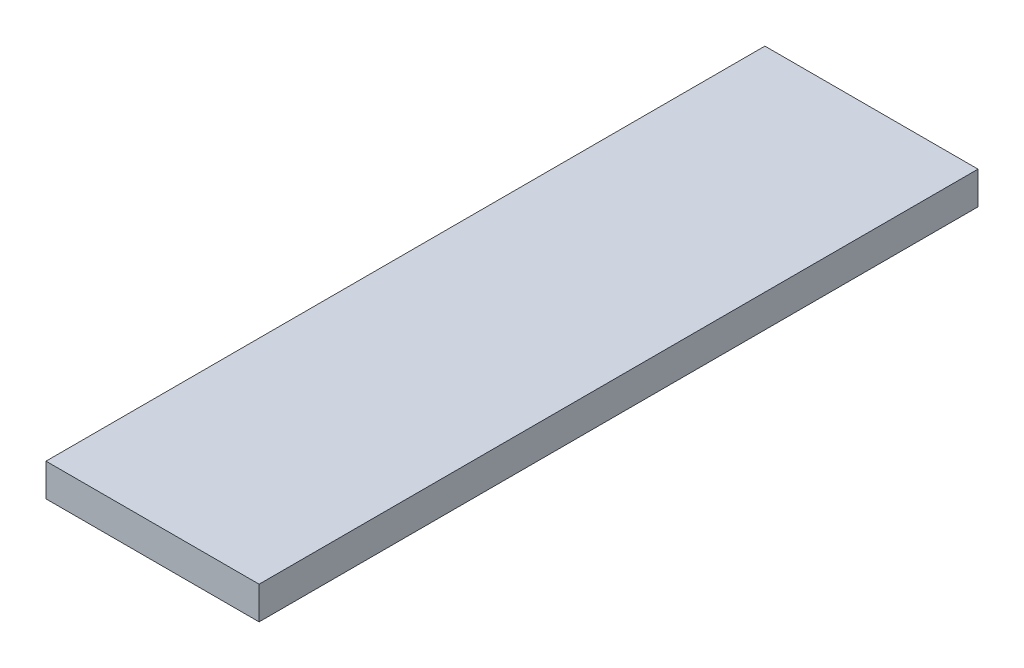
ISO-10303-21;
HEADER;
FILE_DESCRIPTION(('STEP AP214'),'2;1');
FILE_NAME('part.step','',(''),(''),'','','');
FILE_SCHEMA(('AUTOMOTIVE_DESIGN { 1 0 10303 214 1 1 1 1 }'));
ENDSEC;
DATA;
#1=APPLICATION_CONTEXT('core data for automotive mechanical design processes');
#2=APPLICATION_PROTOCOL_DEFINITION('international standard','automotive_design',2000,#1);
#3=PRODUCT_CONTEXT('',#1,'mechanical');
#4=PRODUCT('Part','Part','',(#3));
#5=PRODUCT_RELATED_PRODUCT_CATEGORY('part','',(#4));
#6=PRODUCT_DEFINITION_FORMATION('','',#4);
#7=PRODUCT_DEFINITION_CONTEXT('part definition',#1,'design');
#8=PRODUCT_DEFINITION('design','',#6,#7);
#9=PRODUCT_DEFINITION_SHAPE('','',#8);
#10=(LENGTH_UNIT() NAMED_UNIT(*) SI_UNIT(.MILLI.,.METRE.));
#11=(NAMED_UNIT(*) PLANE_ANGLE_UNIT() SI_UNIT($,.RADIAN.));
#12=(NAMED_UNIT(*) SI_UNIT($,.STERADIAN.) SOLID_ANGLE_UNIT());
#13=UNCERTAINTY_MEASURE_WITH_UNIT(LENGTH_MEASURE(1.E-05),#10,'distance_accuracy_value','');
#14=(GEOMETRIC_REPRESENTATION_CONTEXT(3) GLOBAL_UNCERTAINTY_ASSIGNED_CONTEXT((#13)) GLOBAL_UNIT_ASSIGNED_CONTEXT((#10,
#11,#12)) REPRESENTATION_CONTEXT('',''));
#15=CARTESIAN_POINT('',(0.,0.,0.));
#16=DIRECTION('',(0.,0.,1.));
#17=DIRECTION('',(1.,0.,0.));
#18=AXIS2_PLACEMENT_3D('',#15,#16,#17);
#19=CARTESIAN_POINT('',(20.7058145066696,-6.35,-69.85));
#20=DIRECTION('',(1.,0.,0.));
#21=DIRECTION('',(0.,0.,-1.));
#22=AXIS2_PLACEMENT_3D('',#19,#20,#21);
#23=PLANE('',#22);
#24=DIRECTION('',(0.,0.,-1.));
#25=VECTOR('',#24,1.);
#26=CARTESIAN_POINT('',(20.7058145066696,0.,-69.85));
#27=LINE('',#26,#25);
#28=CARTESIAN_POINT('',(20.7058145066696,0.,69.85));
#29=VERTEX_POINT('',#28);
#30=CARTESIAN_POINT('',(20.7058145066696,0.,-69.85));
#31=VERTEX_POINT('',#30);
#32=EDGE_CURVE('E97',#29,#31,#27,.T.);
#33=ORIENTED_EDGE('',*,*,#32,.F.);
#34=DIRECTION('',(0.,1.,0.));
#35=VECTOR('',#34,1.);
#36=CARTESIAN_POINT('',(20.7058145066696,-6.35,69.85));
#37=LINE('',#36,#35);
#38=CARTESIAN_POINT('',(20.7058145066696,-6.35,69.85));
#39=VERTEX_POINT('',#38);
#40=EDGE_CURVE('E11',#39,#29,#37,.T.);
#41=ORIENTED_EDGE('',*,*,#40,.F.);
#42=DIRECTION('',(0.,0.,-1.));
#43=VECTOR('',#42,1.);
#44=CARTESIAN_POINT('',(20.7058145066696,-6.35,-69.85));
#45=LINE('',#44,#43);
#46=CARTESIAN_POINT('',(20.7058145066696,-6.35,-69.85));
#47=VERTEX_POINT('',#46);
#48=EDGE_CURVE('E91',#39,#47,#45,.T.);
#49=ORIENTED_EDGE('',*,*,#48,.T.);
#50=DIRECTION('',(0.,1.,0.));
#51=VECTOR('',#50,1.);
#52=CARTESIAN_POINT('',(20.7058145066696,-6.35,-69.85));
#53=LINE('',#52,#51);
#54=EDGE_CURVE('E36',#47,#31,#53,.T.);
#55=ORIENTED_EDGE('',*,*,#54,.T.);
#56=EDGE_LOOP('',(#33,#41,#49,#55));
#57=FACE_BOUND('',#56,.T.);
#58=ADVANCED_FACE('F33',(#57),#23,.T.);
#59=CARTESIAN_POINT('',(-20.7058145066696,-6.35,69.85));
#60=DIRECTION('',(0.,0.,1.));
#61=DIRECTION('',(1.,0.,0.));
#62=AXIS2_PLACEMENT_3D('',#59,#60,#61);
#63=PLANE('',#62);
#64=DIRECTION('',(1.,0.,0.));
#65=VECTOR('',#64,1.);
#66=CARTESIAN_POINT('',(-20.7058145066696,0.,69.85));
#67=LINE('',#66,#65);
#68=CARTESIAN_POINT('',(-20.7058145066696,0.,69.85));
#69=VERTEX_POINT('',#68);
#70=EDGE_CURVE('E93',#69,#29,#67,.T.);
#71=ORIENTED_EDGE('',*,*,#70,.F.);
#72=DIRECTION('',(0.,1.,0.));
#73=VECTOR('',#72,1.);
#74=CARTESIAN_POINT('',(-20.7058145066696,-6.35,69.85));
#75=LINE('',#74,#73);
#76=CARTESIAN_POINT('',(-20.7058145066696,-6.35,69.85));
#77=VERTEX_POINT('',#76);
#78=EDGE_CURVE('E42',#77,#69,#75,.T.);
#79=ORIENTED_EDGE('',*,*,#78,.F.);
#80=DIRECTION('',(1.,0.,0.));
#81=VECTOR('',#80,1.);
#82=CARTESIAN_POINT('',(-20.7058145066696,-6.35,69.85));
#83=LINE('',#82,#81);
#84=EDGE_CURVE('E88',#77,#39,#83,.T.);
#85=ORIENTED_EDGE('',*,*,#84,.T.);
#86=ORIENTED_EDGE('',*,*,#40,.T.);
#87=EDGE_LOOP('',(#71,#79,#85,#86));
#88=FACE_BOUND('',#87,.T.);
#89=ADVANCED_FACE('F107',(#88),#63,.T.);
#90=CARTESIAN_POINT('',(-20.7058145066696,-6.35,-69.85));
#91=DIRECTION('',(-1.,0.,0.));
#92=DIRECTION('',(0.,0.,1.));
#93=AXIS2_PLACEMENT_3D('',#90,#91,#92);
#94=PLANE('',#93);
#95=DIRECTION('',(0.,0.,1.));
#96=VECTOR('',#95,1.);
#97=CARTESIAN_POINT('',(-20.7058145066696,0.,-69.85));
#98=LINE('',#97,#96);
#99=CARTESIAN_POINT('',(-20.7058145066696,0.,-69.85));
#100=VERTEX_POINT('',#99);
#101=EDGE_CURVE('E83',#100,#69,#98,.T.);
#102=ORIENTED_EDGE('',*,*,#101,.F.);
#103=DIRECTION('',(0.,1.,0.));
#104=VECTOR('',#103,1.);
#105=CARTESIAN_POINT('',(-20.7058145066696,-6.35,-69.85));
#106=LINE('',#105,#104);
#107=CARTESIAN_POINT('',(-20.7058145066696,-6.35,-69.85));
#108=VERTEX_POINT('',#107);
#109=EDGE_CURVE('E78',#108,#100,#106,.T.);
#110=ORIENTED_EDGE('',*,*,#109,.F.);
#111=DIRECTION('',(0.,0.,1.));
#112=VECTOR('',#111,1.);
#113=CARTESIAN_POINT('',(-20.7058145066696,-6.35,-69.85));
#114=LINE('',#113,#112);
#115=EDGE_CURVE('E81',#108,#77,#114,.T.);
#116=ORIENTED_EDGE('',*,*,#115,.T.);
#117=ORIENTED_EDGE('',*,*,#78,.T.);
#118=EDGE_LOOP('',(#102,#110,#116,#117));
#119=FACE_BOUND('',#118,.T.);
#120=ADVANCED_FACE('F80',(#119),#94,.T.);
#121=CARTESIAN_POINT('',(-20.7058145066696,-6.35,-69.85));
#122=DIRECTION('',(0.,0.,-1.));
#123=DIRECTION('',(-1.,0.,0.));
#124=AXIS2_PLACEMENT_3D('',#121,#122,#123);
#125=PLANE('',#124);
#126=DIRECTION('',(-1.,0.,0.));
#127=VECTOR('',#126,1.);
#128=CARTESIAN_POINT('',(-20.7058145066696,0.,-69.85));
#129=LINE('',#128,#127);
#130=EDGE_CURVE('E100',#31,#100,#129,.T.);
#131=ORIENTED_EDGE('',*,*,#130,.F.);
#132=ORIENTED_EDGE('',*,*,#54,.F.);
#133=DIRECTION('',(-1.,0.,0.));
#134=VECTOR('',#133,1.);
#135=CARTESIAN_POINT('',(-20.7058145066696,-6.35,-69.85));
#136=LINE('',#135,#134);
#137=EDGE_CURVE('E87',#47,#108,#136,.T.);
#138=ORIENTED_EDGE('',*,*,#137,.T.);
#139=ORIENTED_EDGE('',*,*,#109,.T.);
#140=EDGE_LOOP('',(#131,#132,#138,#139));
#141=FACE_BOUND('',#140,.T.);
#142=ADVANCED_FACE('F90',(#141),#125,.T.);
#143=CARTESIAN_POINT('',(0.,-6.35,0.));
#144=DIRECTION('',(0.,1.,0.));
#145=DIRECTION('',(0.,0.,1.));
#146=AXIS2_PLACEMENT_3D('',#143,#144,#145);
#147=PLANE('',#146);
#148=ORIENTED_EDGE('',*,*,#48,.F.);
#149=ORIENTED_EDGE('',*,*,#84,.F.);
#150=ORIENTED_EDGE('',*,*,#115,.F.);
#151=ORIENTED_EDGE('',*,*,#137,.F.);
#152=EDGE_LOOP('',(#148,#149,#150,#151));
#153=FACE_BOUND('',#152,.T.);
#154=ADVANCED_FACE('F86',(#153),#147,.F.);
#155=CARTESIAN_POINT('',(0.,0.,0.));
#156=DIRECTION('',(0.,1.,0.));
#157=DIRECTION('',(0.,0.,1.));
#158=AXIS2_PLACEMENT_3D('',#155,#156,#157);
#159=PLANE('',#158);
#160=ORIENTED_EDGE('',*,*,#32,.T.);
#161=ORIENTED_EDGE('',*,*,#130,.T.);
#162=ORIENTED_EDGE('',*,*,#101,.T.);
#163=ORIENTED_EDGE('',*,*,#70,.T.);
#164=EDGE_LOOP('',(#160,#161,#162,#163));
#165=FACE_BOUND('',#164,.T.);
#166=ADVANCED_FACE('F106',(#165),#159,.T.);
#167=CLOSED_SHELL('',(#58,#89,#120,#142,#154,#166));
#168=MANIFOLD_SOLID_BREP('B2',#167);
#169=ADVANCED_BREP_SHAPE_REPRESENTATION('',(#18,#168),#14);
#170=SHAPE_DEFINITION_REPRESENTATION(#9,#169);
ENDSEC;
END-ISO-10303-21;
